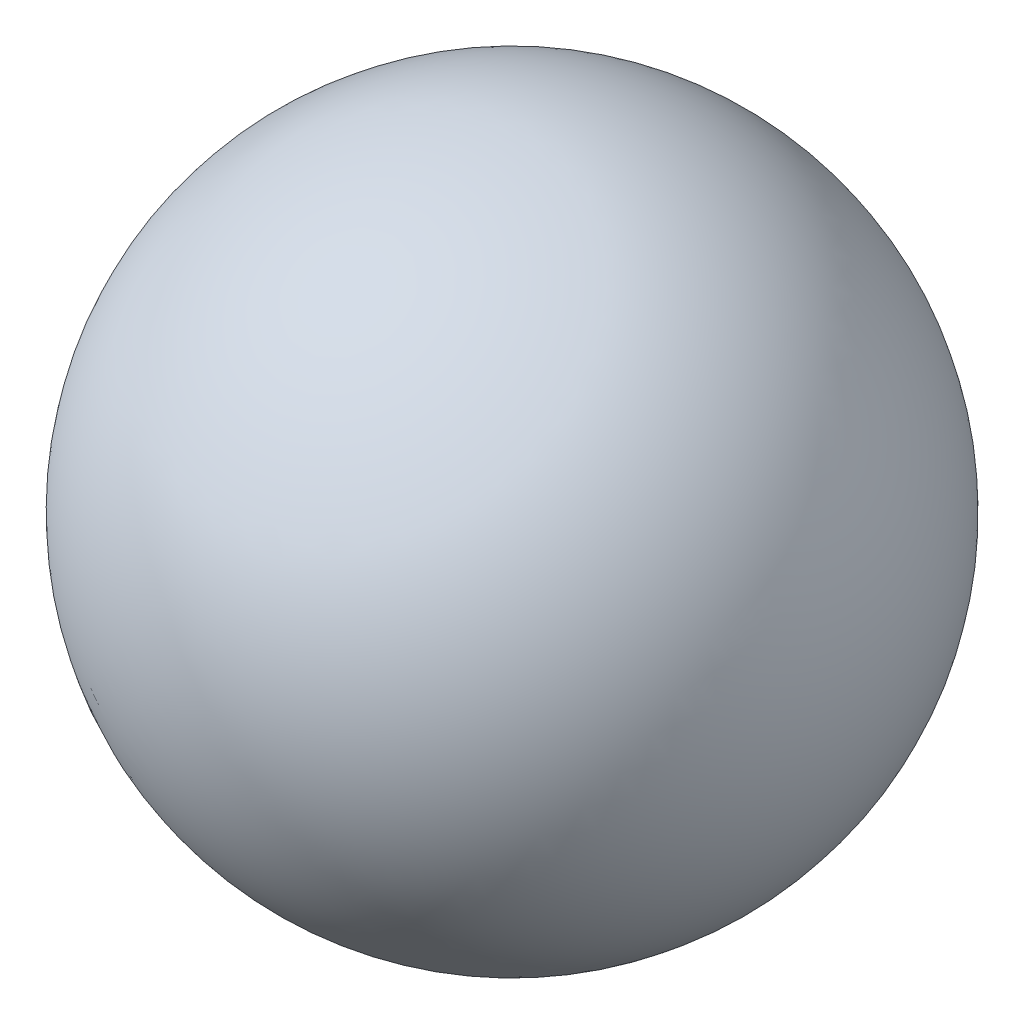
ISO-10303-21;
HEADER;
FILE_DESCRIPTION(('STEP AP214'),'2;1');
FILE_NAME('part.step','',(''),(''),'','','');
FILE_SCHEMA(('AUTOMOTIVE_DESIGN { 1 0 10303 214 1 1 1 1 }'));
ENDSEC;
DATA;
#1=APPLICATION_CONTEXT('core data for automotive mechanical design processes');
#2=APPLICATION_PROTOCOL_DEFINITION('international standard','automotive_design',2000,#1);
#3=PRODUCT_CONTEXT('',#1,'mechanical');
#4=PRODUCT('Part','Part','',(#3));
#5=PRODUCT_RELATED_PRODUCT_CATEGORY('part','',(#4));
#6=PRODUCT_DEFINITION_FORMATION('','',#4);
#7=PRODUCT_DEFINITION_CONTEXT('part definition',#1,'design');
#8=PRODUCT_DEFINITION('design','',#6,#7);
#9=PRODUCT_DEFINITION_SHAPE('','',#8);
#10=(LENGTH_UNIT() NAMED_UNIT(*) SI_UNIT(.MILLI.,.METRE.));
#11=(NAMED_UNIT(*) PLANE_ANGLE_UNIT() SI_UNIT($,.RADIAN.));
#12=(NAMED_UNIT(*) SI_UNIT($,.STERADIAN.) SOLID_ANGLE_UNIT());
#13=UNCERTAINTY_MEASURE_WITH_UNIT(LENGTH_MEASURE(1.E-05),#10,'distance_accuracy_value','');
#14=(GEOMETRIC_REPRESENTATION_CONTEXT(3) GLOBAL_UNCERTAINTY_ASSIGNED_CONTEXT((#13)) GLOBAL_UNIT_ASSIGNED_CONTEXT((#10,
#11,#12)) REPRESENTATION_CONTEXT('',''));
#15=CARTESIAN_POINT('',(0.,0.,0.));
#16=DIRECTION('',(0.,0.,1.));
#17=DIRECTION('',(1.,0.,0.));
#18=AXIS2_PLACEMENT_3D('',#15,#16,#17);
#19=CARTESIAN_POINT('',(0.,0.,0.));
#20=DIRECTION('',(0.4993433009786,0.764133687112802,0.408357656946933));
#21=DIRECTION('',(-0.299338871467601,-0.290144115704575,0.908962393144245));
#22=AXIS2_PLACEMENT_3D('',#19,#20,#21);
#23=SPHERICAL_SURFACE('',#22,1.1905);
#24=CARTESIAN_POINT('',(-0.594468199815024,-0.909701154507791,-0.486149790595324));
#25=VERTEX_POINT('',#24);
#26=VERTEX_LOOP('',#25);
#27=FACE_BOUND('',#26,.T.);
#28=CARTESIAN_POINT('',(0.594468199815024,0.909701154507791,0.486149790595324));
#29=VERTEX_POINT('',#28);
#30=VERTEX_LOOP('',#29);
#31=FACE_BOUND('',#30,.T.);
#32=ADVANCED_FACE('F15',(#27,#31),#23,.T.);
#33=CLOSED_SHELL('',(#32));
#34=MANIFOLD_SOLID_BREP('B1',#33);
#35=ADVANCED_BREP_SHAPE_REPRESENTATION('',(#18,#34),#14);
#36=SHAPE_DEFINITION_REPRESENTATION(#9,#35);
ENDSEC;
END-ISO-10303-21;
